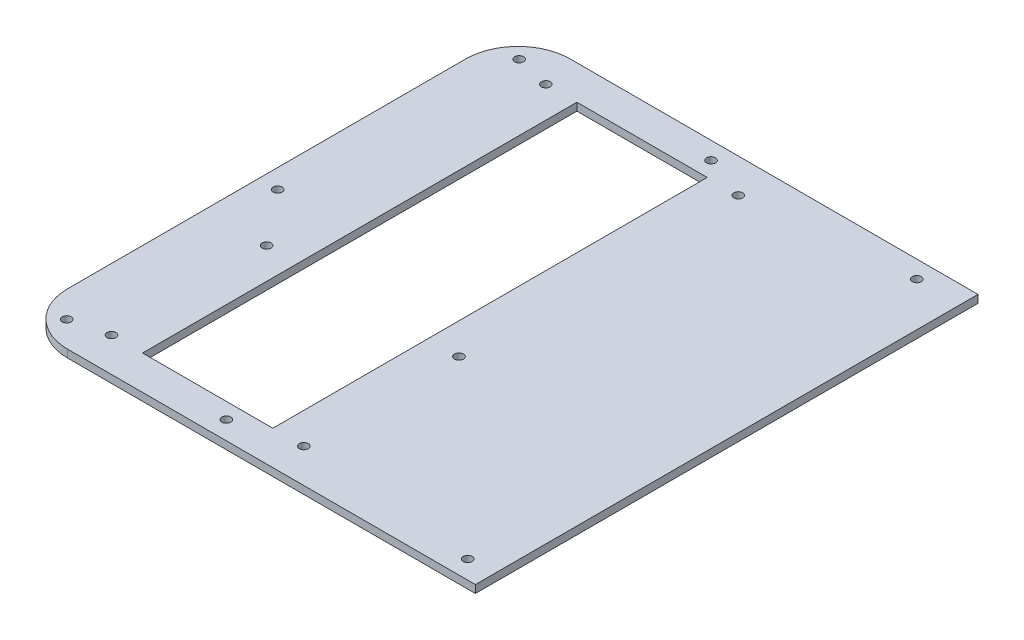
ISO-10303-21;
HEADER;
FILE_DESCRIPTION(('STEP AP214'),'2;1');
FILE_NAME('part.step','',(''),(''),'','','');
FILE_SCHEMA(('AUTOMOTIVE_DESIGN { 1 0 10303 214 1 1 1 1 }'));
ENDSEC;
DATA;
#1=APPLICATION_CONTEXT('core data for automotive mechanical design processes');
#2=APPLICATION_PROTOCOL_DEFINITION('international standard','automotive_design',2000,#1);
#3=PRODUCT_CONTEXT('',#1,'mechanical');
#4=PRODUCT('Part','Part','',(#3));
#5=PRODUCT_RELATED_PRODUCT_CATEGORY('part','',(#4));
#6=PRODUCT_DEFINITION_FORMATION('','',#4);
#7=PRODUCT_DEFINITION_CONTEXT('part definition',#1,'design');
#8=PRODUCT_DEFINITION('design','',#6,#7);
#9=PRODUCT_DEFINITION_SHAPE('','',#8);
#10=(LENGTH_UNIT() NAMED_UNIT(*) SI_UNIT(.MILLI.,.METRE.));
#11=(NAMED_UNIT(*) PLANE_ANGLE_UNIT() SI_UNIT($,.RADIAN.));
#12=(NAMED_UNIT(*) SI_UNIT($,.STERADIAN.) SOLID_ANGLE_UNIT());
#13=UNCERTAINTY_MEASURE_WITH_UNIT(LENGTH_MEASURE(1.E-05),#10,'distance_accuracy_value','');
#14=(GEOMETRIC_REPRESENTATION_CONTEXT(3) GLOBAL_UNCERTAINTY_ASSIGNED_CONTEXT((#13)) GLOBAL_UNIT_ASSIGNED_CONTEXT((#10,
#11,#12)) REPRESENTATION_CONTEXT('',''));
#15=CARTESIAN_POINT('',(0.,0.,0.));
#16=DIRECTION('',(0.,0.,1.));
#17=DIRECTION('',(1.,0.,0.));
#18=AXIS2_PLACEMENT_3D('',#15,#16,#17);
#19=CARTESIAN_POINT('',(-106.934,3.175,81.534));
#20=DIRECTION('',(0.,-1.,0.));
#21=DIRECTION('',(0.,0.,-1.));
#22=AXIS2_PLACEMENT_3D('',#19,#20,#21);
#23=PLANE('',#22);
#24=CARTESIAN_POINT('',(42.1132,3.175,-95.7453));
#25=DIRECTION('',(0.,1.,0.));
#26=DIRECTION('',(0.,0.,1.));
#27=AXIS2_PLACEMENT_3D('',#24,#25,#26);
#28=CIRCLE('',#27,1.82879999999998);
#29=CARTESIAN_POINT('',(42.1132,3.175,-93.9165));
#30=VERTEX_POINT('',#29);
#31=EDGE_CURVE('E196',#30,#30,#28,.T.);
#32=ORIENTED_EDGE('',*,*,#31,.F.);
#33=EDGE_LOOP('',(#32));
#34=FACE_BOUND('',#33,.T.);
#35=CARTESIAN_POINT('',(49.403,3.175,95.3643));
#36=DIRECTION('',(0.,1.,0.));
#37=DIRECTION('',(0.,0.,1.));
#38=AXIS2_PLACEMENT_3D('',#35,#36,#37);
#39=CIRCLE('',#38,1.82879999999998);
#40=CARTESIAN_POINT('',(49.403,3.175,97.1931));
#41=VERTEX_POINT('',#40);
#42=EDGE_CURVE('E206',#41,#41,#39,.T.);
#43=ORIENTED_EDGE('',*,*,#42,.F.);
#44=EDGE_LOOP('',(#43));
#45=FACE_BOUND('',#44,.T.);
#46=CARTESIAN_POINT('',(-49.403,3.175,95.3643));
#47=DIRECTION('',(0.,1.,0.));
#48=DIRECTION('',(0.,0.,1.));
#49=AXIS2_PLACEMENT_3D('',#46,#47,#48);
#50=CIRCLE('',#49,1.82879999999998);
#51=CARTESIAN_POINT('',(-49.403,3.175,97.1931));
#52=VERTEX_POINT('',#51);
#53=EDGE_CURVE('E214',#52,#52,#50,.T.);
#54=ORIENTED_EDGE('',*,*,#53,.F.);
#55=EDGE_LOOP('',(#54));
#56=FACE_BOUND('',#55,.T.);
#57=CARTESIAN_POINT('',(-117.6274,3.175,92.5195));
#58=DIRECTION('',(0.,1.,0.));
#59=DIRECTION('',(0.,0.,1.));
#60=AXIS2_PLACEMENT_3D('',#57,#58,#59);
#61=CIRCLE('',#60,1.82879999999999);
#62=CARTESIAN_POINT('',(-117.6274,3.175,94.3483));
#63=VERTEX_POINT('',#62);
#64=EDGE_CURVE('E222',#63,#63,#61,.T.);
#65=ORIENTED_EDGE('',*,*,#64,.F.);
#66=EDGE_LOOP('',(#65));
#67=FACE_BOUND('',#66,.T.);
#68=CARTESIAN_POINT('',(-120.4468,3.175,3.3147));
#69=DIRECTION('',(0.,1.,0.));
#70=DIRECTION('',(0.,0.,1.));
#71=AXIS2_PLACEMENT_3D('',#68,#69,#70);
#72=CIRCLE('',#71,1.82879999999999);
#73=CARTESIAN_POINT('',(-120.4468,3.175,5.1435));
#74=VERTEX_POINT('',#73);
#75=EDGE_CURVE('E230',#74,#74,#72,.T.);
#76=ORIENTED_EDGE('',*,*,#75,.F.);
#77=EDGE_LOOP('',(#76));
#78=FACE_BOUND('',#77,.T.);
#79=CARTESIAN_POINT('',(-117.221,3.175,-92.2909));
#80=DIRECTION('',(0.,1.,0.));
#81=DIRECTION('',(0.,0.,1.));
#82=AXIS2_PLACEMENT_3D('',#79,#80,#81);
#83=CIRCLE('',#82,1.82879999999999);
#84=CARTESIAN_POINT('',(-117.221,3.175,-90.4621));
#85=VERTEX_POINT('',#84);
#86=EDGE_CURVE('E238',#85,#85,#83,.T.);
#87=ORIENTED_EDGE('',*,*,#86,.F.);
#88=EDGE_LOOP('',(#87));
#89=FACE_BOUND('',#88,.T.);
#90=CARTESIAN_POINT('',(-42.1132,3.175,-95.7453));
#91=DIRECTION('',(0.,1.,0.));
#92=DIRECTION('',(0.,0.,1.));
#93=AXIS2_PLACEMENT_3D('',#90,#91,#92);
#94=CIRCLE('',#93,1.82879999999998);
#95=CARTESIAN_POINT('',(-42.1132,3.175,-93.9165));
#96=VERTEX_POINT('',#95);
#97=EDGE_CURVE('E246',#96,#96,#94,.T.);
#98=ORIENTED_EDGE('',*,*,#97,.F.);
#99=EDGE_LOOP('',(#98));
#100=FACE_BOUND('',#99,.T.);
#101=CARTESIAN_POINT('',(-24.13,3.175,25.4));
#102=DIRECTION('',(0.,1.,0.));
#103=DIRECTION('',(0.,0.,1.));
#104=AXIS2_PLACEMENT_3D('',#101,#102,#103);
#105=CIRCLE('',#104,1.82879999999999);
#106=CARTESIAN_POINT('',(-24.13,3.175,27.2288));
#107=VERTEX_POINT('',#106);
#108=EDGE_CURVE('E254',#107,#107,#105,.T.);
#109=ORIENTED_EDGE('',*,*,#108,.F.);
#110=EDGE_LOOP('',(#109));
#111=FACE_BOUND('',#110,.T.);
#112=CARTESIAN_POINT('',(-24.13,3.175,-88.9));
#113=DIRECTION('',(0.,1.,0.));
#114=DIRECTION('',(0.,0.,1.));
#115=AXIS2_PLACEMENT_3D('',#112,#113,#114);
#116=CIRCLE('',#115,1.82879999999999);
#117=CARTESIAN_POINT('',(-24.13,3.175,-87.0712));
#118=VERTEX_POINT('',#117);
#119=EDGE_CURVE('E262',#118,#118,#116,.T.);
#120=ORIENTED_EDGE('',*,*,#119,.F.);
#121=EDGE_LOOP('',(#120));
#122=FACE_BOUND('',#121,.T.);
#123=CARTESIAN_POINT('',(-102.87,3.175,-88.9));
#124=DIRECTION('',(0.,1.,0.));
#125=DIRECTION('',(0.,0.,1.));
#126=AXIS2_PLACEMENT_3D('',#123,#124,#125);
#127=CIRCLE('',#126,1.82879999999999);
#128=CARTESIAN_POINT('',(-102.87,3.175,-87.0712));
#129=VERTEX_POINT('',#128);
#130=EDGE_CURVE('E270',#129,#129,#127,.T.);
#131=ORIENTED_EDGE('',*,*,#130,.F.);
#132=EDGE_LOOP('',(#131));
#133=FACE_BOUND('',#132,.T.);
#134=CARTESIAN_POINT('',(-102.87,3.175,25.4));
#135=DIRECTION('',(0.,1.,0.));
#136=DIRECTION('',(0.,0.,1.));
#137=AXIS2_PLACEMENT_3D('',#134,#135,#136);
#138=CIRCLE('',#137,1.82879999999999);
#139=CARTESIAN_POINT('',(-102.87,3.175,27.2288));
#140=VERTEX_POINT('',#139);
#141=EDGE_CURVE('E278',#140,#140,#138,.T.);
#142=ORIENTED_EDGE('',*,*,#141,.F.);
#143=EDGE_LOOP('',(#142));
#144=FACE_BOUND('',#143,.T.);
#145=CARTESIAN_POINT('',(-102.87,3.175,88.9));
#146=DIRECTION('',(0.,1.,0.));
#147=DIRECTION('',(0.,0.,1.));
#148=AXIS2_PLACEMENT_3D('',#145,#146,#147);
#149=CIRCLE('',#148,1.82879999999999);
#150=CARTESIAN_POINT('',(-102.87,3.175,90.7288));
#151=VERTEX_POINT('',#150);
#152=EDGE_CURVE('E286',#151,#151,#149,.T.);
#153=ORIENTED_EDGE('',*,*,#152,.F.);
#154=EDGE_LOOP('',(#153));
#155=FACE_BOUND('',#154,.T.);
#156=CARTESIAN_POINT('',(-24.13,3.175,88.9));
#157=DIRECTION('',(0.,1.,0.));
#158=DIRECTION('',(0.,0.,1.));
#159=AXIS2_PLACEMENT_3D('',#156,#157,#158);
#160=CIRCLE('',#159,1.82879999999999);
#161=CARTESIAN_POINT('',(-24.13,3.175,90.7288));
#162=VERTEX_POINT('',#161);
#163=EDGE_CURVE('E294',#162,#162,#160,.T.);
#164=ORIENTED_EDGE('',*,*,#163,.F.);
#165=EDGE_LOOP('',(#164));
#166=FACE_BOUND('',#165,.T.);
#167=DIRECTION('',(1.,0.,0.));
#168=VECTOR('',#167,1.);
#169=CARTESIAN_POINT('',(-106.934,3.175,102.87));
#170=LINE('',#169,#168);
#171=CARTESIAN_POINT('',(-106.934,3.175,102.87));
#172=VERTEX_POINT('',#171);
#173=CARTESIAN_POINT('',(60.0455999999999,3.175,102.87));
#174=VERTEX_POINT('',#173);
#175=EDGE_CURVE('E131',#172,#174,#170,.T.);
#176=ORIENTED_EDGE('',*,*,#175,.T.);
#177=DIRECTION('',(0.,0.,1.));
#178=VECTOR('',#177,1.);
#179=CARTESIAN_POINT('',(60.0455999999999,3.175,127.));
#180=LINE('',#179,#178);
#181=CARTESIAN_POINT('',(60.0455999999999,3.175,-102.87));
#182=VERTEX_POINT('',#181);
#183=EDGE_CURVE('E120',#182,#174,#180,.T.);
#184=ORIENTED_EDGE('',*,*,#183,.F.);
#185=DIRECTION('',(-1.,0.,0.));
#186=VECTOR('',#185,1.);
#187=CARTESIAN_POINT('',(-106.934,3.175,-102.87));
#188=LINE('',#187,#186);
#189=CARTESIAN_POINT('',(-106.934,3.175,-102.87));
#190=VERTEX_POINT('',#189);
#191=EDGE_CURVE('E128',#182,#190,#188,.T.);
#192=ORIENTED_EDGE('',*,*,#191,.T.);
#193=CARTESIAN_POINT('',(-106.934,3.175,-81.534));
#194=DIRECTION('',(0.,1.,0.));
#195=DIRECTION('',(0.,0.,-1.));
#196=AXIS2_PLACEMENT_3D('',#193,#194,#195);
#197=CIRCLE('',#196,21.336);
#198=CARTESIAN_POINT('',(-128.27,3.175,-81.5339999999998));
#199=VERTEX_POINT('',#198);
#200=EDGE_CURVE('E139',#190,#199,#197,.T.);
#201=ORIENTED_EDGE('',*,*,#200,.T.);
#202=DIRECTION('',(0.,0.,1.));
#203=VECTOR('',#202,1.);
#204=CARTESIAN_POINT('',(-128.27,3.175,81.5339999999998));
#205=LINE('',#204,#203);
#206=CARTESIAN_POINT('',(-128.27,3.175,81.5339999999998));
#207=VERTEX_POINT('',#206);
#208=EDGE_CURVE('E143',#199,#207,#205,.T.);
#209=ORIENTED_EDGE('',*,*,#208,.T.);
#210=CARTESIAN_POINT('',(-106.934,3.175,81.534));
#211=DIRECTION('',(0.,1.,0.));
#212=DIRECTION('',(0.,0.,-1.));
#213=AXIS2_PLACEMENT_3D('',#210,#211,#212);
#214=CIRCLE('',#213,21.336);
#215=EDGE_CURVE('E145',#207,#172,#214,.T.);
#216=ORIENTED_EDGE('',*,*,#215,.T.);
#217=EDGE_LOOP('',(#176,#184,#192,#201,#209,#216));
#218=FACE_BOUND('',#217,.T.);
#219=DIRECTION('',(0.,0.,-1.));
#220=VECTOR('',#219,1.);
#221=CARTESIAN_POINT('',(-36.83,3.175,-88.9));
#222=LINE('',#221,#220);
#223=CARTESIAN_POINT('',(-36.83,3.175,88.9));
#224=VERTEX_POINT('',#223);
#225=CARTESIAN_POINT('',(-36.83,3.175,-88.9));
#226=VERTEX_POINT('',#225);
#227=EDGE_CURVE('E303',#224,#226,#222,.T.);
#228=ORIENTED_EDGE('',*,*,#227,.F.);
#229=DIRECTION('',(1.,0.,0.));
#230=VECTOR('',#229,1.);
#231=CARTESIAN_POINT('',(-90.17,3.175,88.9));
#232=LINE('',#231,#230);
#233=CARTESIAN_POINT('',(-90.17,3.175,88.9));
#234=VERTEX_POINT('',#233);
#235=EDGE_CURVE('E313',#234,#224,#232,.T.);
#236=ORIENTED_EDGE('',*,*,#235,.F.);
#237=DIRECTION('',(0.,0.,1.));
#238=VECTOR('',#237,1.);
#239=CARTESIAN_POINT('',(-90.17,3.175,-88.9));
#240=LINE('',#239,#238);
#241=CARTESIAN_POINT('',(-90.17,3.175,-88.9));
#242=VERTEX_POINT('',#241);
#243=EDGE_CURVE('E310',#242,#234,#240,.T.);
#244=ORIENTED_EDGE('',*,*,#243,.F.);
#245=DIRECTION('',(-1.,0.,0.));
#246=VECTOR('',#245,1.);
#247=CARTESIAN_POINT('',(-90.17,3.175,-88.9));
#248=LINE('',#247,#246);
#249=EDGE_CURVE('E306',#226,#242,#248,.T.);
#250=ORIENTED_EDGE('',*,*,#249,.F.);
#251=EDGE_LOOP('',(#228,#236,#244,#250));
#252=FACE_BOUND('',#251,.T.);
#253=ADVANCED_FACE('F44',(#34,#45,#56,#67,#78,#89,#100,#111,#122,#133,#144,#155,#166,#218,#252),
#23,.F.);
#254=CARTESIAN_POINT('',(-106.934,0.,81.534));
#255=DIRECTION('',(0.,-1.,0.));
#256=DIRECTION('',(0.,0.,-1.));
#257=AXIS2_PLACEMENT_3D('',#254,#255,#256);
#258=PLANE('',#257);
#259=DIRECTION('',(0.,0.,-1.));
#260=VECTOR('',#259,1.);
#261=CARTESIAN_POINT('',(60.0455999999999,0.,81.534));
#262=LINE('',#261,#260);
#263=CARTESIAN_POINT('',(60.0455999999999,0.,102.87));
#264=VERTEX_POINT('',#263);
#265=CARTESIAN_POINT('',(60.0455999999999,0.,-102.87));
#266=VERTEX_POINT('',#265);
#267=EDGE_CURVE('E60',#264,#266,#262,.T.);
#268=ORIENTED_EDGE('',*,*,#267,.F.);
#269=DIRECTION('',(1.,0.,0.));
#270=VECTOR('',#269,1.);
#271=CARTESIAN_POINT('',(-106.934,0.,102.87));
#272=LINE('',#271,#270);
#273=CARTESIAN_POINT('',(-106.934,0.,102.87));
#274=VERTEX_POINT('',#273);
#275=EDGE_CURVE('E156',#274,#264,#272,.T.);
#276=ORIENTED_EDGE('',*,*,#275,.F.);
#277=CARTESIAN_POINT('',(-106.934,0.,81.534));
#278=DIRECTION('',(0.,1.,0.));
#279=DIRECTION('',(0.,0.,-1.));
#280=AXIS2_PLACEMENT_3D('',#277,#278,#279);
#281=CIRCLE('',#280,21.336);
#282=CARTESIAN_POINT('',(-128.27,0.,81.5339999999998));
#283=VERTEX_POINT('',#282);
#284=EDGE_CURVE('E152',#283,#274,#281,.T.);
#285=ORIENTED_EDGE('',*,*,#284,.F.);
#286=DIRECTION('',(0.,0.,1.));
#287=VECTOR('',#286,1.);
#288=CARTESIAN_POINT('',(-128.27,0.,81.5339999999998));
#289=LINE('',#288,#287);
#290=CARTESIAN_POINT('',(-128.27,0.,-81.5339999999998));
#291=VERTEX_POINT('',#290);
#292=EDGE_CURVE('E167',#291,#283,#289,.T.);
#293=ORIENTED_EDGE('',*,*,#292,.F.);
#294=CARTESIAN_POINT('',(-106.934,0.,-81.534));
#295=DIRECTION('',(0.,1.,0.));
#296=DIRECTION('',(0.,0.,-1.));
#297=AXIS2_PLACEMENT_3D('',#294,#295,#296);
#298=CIRCLE('',#297,21.336);
#299=CARTESIAN_POINT('',(-106.934,0.,-102.87));
#300=VERTEX_POINT('',#299);
#301=EDGE_CURVE('E164',#300,#291,#298,.T.);
#302=ORIENTED_EDGE('',*,*,#301,.F.);
#303=DIRECTION('',(-1.,0.,0.));
#304=VECTOR('',#303,1.);
#305=CARTESIAN_POINT('',(-106.934,0.,-102.87));
#306=LINE('',#305,#304);
#307=EDGE_CURVE('E161',#266,#300,#306,.T.);
#308=ORIENTED_EDGE('',*,*,#307,.F.);
#309=EDGE_LOOP('',(#268,#276,#285,#293,#302,#308));
#310=FACE_BOUND('',#309,.T.);
#311=CARTESIAN_POINT('',(42.1132,0.,-95.7453));
#312=DIRECTION('',(0.,1.,0.));
#313=DIRECTION('',(0.,0.,1.));
#314=AXIS2_PLACEMENT_3D('',#311,#312,#313);
#315=CIRCLE('',#314,1.8288);
#316=CARTESIAN_POINT('',(42.1132,0.,-93.9165));
#317=VERTEX_POINT('',#316);
#318=EDGE_CURVE('E202',#317,#317,#315,.T.);
#319=ORIENTED_EDGE('',*,*,#318,.T.);
#320=EDGE_LOOP('',(#319));
#321=FACE_BOUND('',#320,.T.);
#322=CARTESIAN_POINT('',(49.403,0.,95.3643));
#323=DIRECTION('',(0.,1.,0.));
#324=DIRECTION('',(0.,0.,1.));
#325=AXIS2_PLACEMENT_3D('',#322,#323,#324);
#326=CIRCLE('',#325,1.8288);
#327=CARTESIAN_POINT('',(49.403,0.,97.1931));
#328=VERTEX_POINT('',#327);
#329=EDGE_CURVE('E210',#328,#328,#326,.T.);
#330=ORIENTED_EDGE('',*,*,#329,.T.);
#331=EDGE_LOOP('',(#330));
#332=FACE_BOUND('',#331,.T.);
#333=CARTESIAN_POINT('',(-49.403,0.,95.3643));
#334=DIRECTION('',(0.,1.,0.));
#335=DIRECTION('',(0.,0.,1.));
#336=AXIS2_PLACEMENT_3D('',#333,#334,#335);
#337=CIRCLE('',#336,1.8288);
#338=CARTESIAN_POINT('',(-49.403,0.,97.1931));
#339=VERTEX_POINT('',#338);
#340=EDGE_CURVE('E218',#339,#339,#337,.T.);
#341=ORIENTED_EDGE('',*,*,#340,.T.);
#342=EDGE_LOOP('',(#341));
#343=FACE_BOUND('',#342,.T.);
#344=CARTESIAN_POINT('',(-117.6274,0.,92.5195));
#345=DIRECTION('',(0.,1.,0.));
#346=DIRECTION('',(0.,0.,1.));
#347=AXIS2_PLACEMENT_3D('',#344,#345,#346);
#348=CIRCLE('',#347,1.82880000000001);
#349=CARTESIAN_POINT('',(-117.6274,0.,94.3483));
#350=VERTEX_POINT('',#349);
#351=EDGE_CURVE('E226',#350,#350,#348,.T.);
#352=ORIENTED_EDGE('',*,*,#351,.T.);
#353=EDGE_LOOP('',(#352));
#354=FACE_BOUND('',#353,.T.);
#355=CARTESIAN_POINT('',(-120.4468,0.,3.3147));
#356=DIRECTION('',(0.,1.,0.));
#357=DIRECTION('',(0.,0.,1.));
#358=AXIS2_PLACEMENT_3D('',#355,#356,#357);
#359=CIRCLE('',#358,1.82880000000001);
#360=CARTESIAN_POINT('',(-120.4468,0.,5.14350000000001));
#361=VERTEX_POINT('',#360);
#362=EDGE_CURVE('E234',#361,#361,#359,.T.);
#363=ORIENTED_EDGE('',*,*,#362,.T.);
#364=EDGE_LOOP('',(#363));
#365=FACE_BOUND('',#364,.T.);
#366=CARTESIAN_POINT('',(-117.221,0.,-92.2909));
#367=DIRECTION('',(0.,1.,0.));
#368=DIRECTION('',(0.,0.,1.));
#369=AXIS2_PLACEMENT_3D('',#366,#367,#368);
#370=CIRCLE('',#369,1.82880000000001);
#371=CARTESIAN_POINT('',(-117.221,0.,-90.4621));
#372=VERTEX_POINT('',#371);
#373=EDGE_CURVE('E242',#372,#372,#370,.T.);
#374=ORIENTED_EDGE('',*,*,#373,.T.);
#375=EDGE_LOOP('',(#374));
#376=FACE_BOUND('',#375,.T.);
#377=CARTESIAN_POINT('',(-42.1132,0.,-95.7453));
#378=DIRECTION('',(0.,1.,0.));
#379=DIRECTION('',(0.,0.,1.));
#380=AXIS2_PLACEMENT_3D('',#377,#378,#379);
#381=CIRCLE('',#380,1.8288);
#382=CARTESIAN_POINT('',(-42.1132,0.,-93.9165));
#383=VERTEX_POINT('',#382);
#384=EDGE_CURVE('E250',#383,#383,#381,.T.);
#385=ORIENTED_EDGE('',*,*,#384,.T.);
#386=EDGE_LOOP('',(#385));
#387=FACE_BOUND('',#386,.T.);
#388=CARTESIAN_POINT('',(-24.13,0.,25.4));
#389=DIRECTION('',(0.,1.,0.));
#390=DIRECTION('',(0.,0.,1.));
#391=AXIS2_PLACEMENT_3D('',#388,#389,#390);
#392=CIRCLE('',#391,1.8288);
#393=CARTESIAN_POINT('',(-24.13,0.,27.2288));
#394=VERTEX_POINT('',#393);
#395=EDGE_CURVE('E258',#394,#394,#392,.T.);
#396=ORIENTED_EDGE('',*,*,#395,.T.);
#397=EDGE_LOOP('',(#396));
#398=FACE_BOUND('',#397,.T.);
#399=CARTESIAN_POINT('',(-24.13,0.,-88.9));
#400=DIRECTION('',(0.,1.,0.));
#401=DIRECTION('',(0.,0.,1.));
#402=AXIS2_PLACEMENT_3D('',#399,#400,#401);
#403=CIRCLE('',#402,1.8288);
#404=CARTESIAN_POINT('',(-24.13,0.,-87.0712));
#405=VERTEX_POINT('',#404);
#406=EDGE_CURVE('E266',#405,#405,#403,.T.);
#407=ORIENTED_EDGE('',*,*,#406,.T.);
#408=EDGE_LOOP('',(#407));
#409=FACE_BOUND('',#408,.T.);
#410=CARTESIAN_POINT('',(-102.87,0.,-88.9));
#411=DIRECTION('',(0.,1.,0.));
#412=DIRECTION('',(0.,0.,1.));
#413=AXIS2_PLACEMENT_3D('',#410,#411,#412);
#414=CIRCLE('',#413,1.82880000000001);
#415=CARTESIAN_POINT('',(-102.87,0.,-87.0712));
#416=VERTEX_POINT('',#415);
#417=EDGE_CURVE('E274',#416,#416,#414,.T.);
#418=ORIENTED_EDGE('',*,*,#417,.T.);
#419=EDGE_LOOP('',(#418));
#420=FACE_BOUND('',#419,.T.);
#421=CARTESIAN_POINT('',(-102.87,0.,25.4));
#422=DIRECTION('',(0.,1.,0.));
#423=DIRECTION('',(0.,0.,1.));
#424=AXIS2_PLACEMENT_3D('',#421,#422,#423);
#425=CIRCLE('',#424,1.82880000000001);
#426=CARTESIAN_POINT('',(-102.87,0.,27.2288));
#427=VERTEX_POINT('',#426);
#428=EDGE_CURVE('E282',#427,#427,#425,.T.);
#429=ORIENTED_EDGE('',*,*,#428,.T.);
#430=EDGE_LOOP('',(#429));
#431=FACE_BOUND('',#430,.T.);
#432=CARTESIAN_POINT('',(-102.87,0.,88.9));
#433=DIRECTION('',(0.,1.,0.));
#434=DIRECTION('',(0.,0.,1.));
#435=AXIS2_PLACEMENT_3D('',#432,#433,#434);
#436=CIRCLE('',#435,1.82880000000001);
#437=CARTESIAN_POINT('',(-102.87,0.,90.7288));
#438=VERTEX_POINT('',#437);
#439=EDGE_CURVE('E290',#438,#438,#436,.T.);
#440=ORIENTED_EDGE('',*,*,#439,.T.);
#441=EDGE_LOOP('',(#440));
#442=FACE_BOUND('',#441,.T.);
#443=CARTESIAN_POINT('',(-24.13,0.,88.9));
#444=DIRECTION('',(0.,1.,0.));
#445=DIRECTION('',(0.,0.,1.));
#446=AXIS2_PLACEMENT_3D('',#443,#444,#445);
#447=CIRCLE('',#446,1.8288);
#448=CARTESIAN_POINT('',(-24.13,0.,90.7288));
#449=VERTEX_POINT('',#448);
#450=EDGE_CURVE('E298',#449,#449,#447,.T.);
#451=ORIENTED_EDGE('',*,*,#450,.T.);
#452=EDGE_LOOP('',(#451));
#453=FACE_BOUND('',#452,.T.);
#454=DIRECTION('',(1.,0.,0.));
#455=VECTOR('',#454,1.);
#456=CARTESIAN_POINT('',(-90.17,0.,88.9));
#457=LINE('',#456,#455);
#458=CARTESIAN_POINT('',(-90.17,0.,88.9));
#459=VERTEX_POINT('',#458);
#460=CARTESIAN_POINT('',(-36.83,0.,88.9));
#461=VERTEX_POINT('',#460);
#462=EDGE_CURVE('E307',#459,#461,#457,.T.);
#463=ORIENTED_EDGE('',*,*,#462,.T.);
#464=DIRECTION('',(0.,0.,-1.));
#465=VECTOR('',#464,1.);
#466=CARTESIAN_POINT('',(-36.83,0.,-88.9));
#467=LINE('',#466,#465);
#468=CARTESIAN_POINT('',(-36.83,0.,-88.9));
#469=VERTEX_POINT('',#468);
#470=EDGE_CURVE('E302',#461,#469,#467,.T.);
#471=ORIENTED_EDGE('',*,*,#470,.T.);
#472=DIRECTION('',(-1.,0.,0.));
#473=VECTOR('',#472,1.);
#474=CARTESIAN_POINT('',(-90.17,0.,-88.9));
#475=LINE('',#474,#473);
#476=CARTESIAN_POINT('',(-90.17,0.,-88.9));
#477=VERTEX_POINT('',#476);
#478=EDGE_CURVE('E320',#469,#477,#475,.T.);
#479=ORIENTED_EDGE('',*,*,#478,.T.);
#480=DIRECTION('',(0.,0.,1.));
#481=VECTOR('',#480,1.);
#482=CARTESIAN_POINT('',(-90.17,0.,-88.9));
#483=LINE('',#482,#481);
#484=EDGE_CURVE('E324',#477,#459,#483,.T.);
#485=ORIENTED_EDGE('',*,*,#484,.T.);
#486=EDGE_LOOP('',(#463,#471,#479,#485));
#487=FACE_BOUND('',#486,.T.);
#488=ADVANCED_FACE('F189',(#310,#321,#332,#343,#354,#365,#376,#387,#398,#409,#420,#431,#442,
#453,#487),#258,.T.);
#489=CARTESIAN_POINT('',(-106.934,3.175,81.534));
#490=DIRECTION('',(0.,-1.,0.));
#491=DIRECTION('',(0.,0.,-1.));
#492=AXIS2_PLACEMENT_3D('',#489,#490,#491);
#493=CYLINDRICAL_SURFACE('',#492,21.336);
#494=ORIENTED_EDGE('',*,*,#284,.T.);
#495=DIRECTION('',(0.,-1.,0.));
#496=VECTOR('',#495,1.);
#497=CARTESIAN_POINT('',(-106.934,3.175,102.87));
#498=LINE('',#497,#496);
#499=EDGE_CURVE('E53',#172,#274,#498,.T.);
#500=ORIENTED_EDGE('',*,*,#499,.F.);
#501=ORIENTED_EDGE('',*,*,#215,.F.);
#502=DIRECTION('',(0.,-1.,0.));
#503=VECTOR('',#502,1.);
#504=CARTESIAN_POINT('',(-128.27,3.175,81.5339999999998));
#505=LINE('',#504,#503);
#506=EDGE_CURVE('E151',#207,#283,#505,.T.);
#507=ORIENTED_EDGE('',*,*,#506,.T.);
#508=EDGE_LOOP('',(#494,#500,#501,#507));
#509=FACE_BOUND('',#508,.T.);
#510=ADVANCED_FACE('F46',(#509),#493,.T.);
#511=CARTESIAN_POINT('',(-106.934,3.175,102.87));
#512=DIRECTION('',(0.,0.,-1.));
#513=DIRECTION('',(-1.,0.,0.));
#514=AXIS2_PLACEMENT_3D('',#511,#512,#513);
#515=PLANE('',#514);
#516=ORIENTED_EDGE('',*,*,#275,.T.);
#517=DIRECTION('',(0.,1.,0.));
#518=VECTOR('',#517,1.);
#519=CARTESIAN_POINT('',(60.0455999999999,3.175,102.87));
#520=LINE('',#519,#518);
#521=EDGE_CURVE('E193',#264,#174,#520,.T.);
#522=ORIENTED_EDGE('',*,*,#521,.T.);
#523=ORIENTED_EDGE('',*,*,#175,.F.);
#524=ORIENTED_EDGE('',*,*,#499,.T.);
#525=EDGE_LOOP('',(#516,#522,#523,#524));
#526=FACE_BOUND('',#525,.T.);
#527=ADVANCED_FACE('F182',(#526),#515,.F.);
#528=CARTESIAN_POINT('',(-106.934,3.175,-102.87));
#529=DIRECTION('',(0.,0.,1.));
#530=DIRECTION('',(1.,0.,0.));
#531=AXIS2_PLACEMENT_3D('',#528,#529,#530);
#532=PLANE('',#531);
#533=ORIENTED_EDGE('',*,*,#191,.F.);
#534=DIRECTION('',(0.,-1.,0.));
#535=VECTOR('',#534,1.);
#536=CARTESIAN_POINT('',(60.0455999999999,3.175,-102.87));
#537=LINE('',#536,#535);
#538=EDGE_CURVE('E11',#182,#266,#537,.T.);
#539=ORIENTED_EDGE('',*,*,#538,.T.);
#540=ORIENTED_EDGE('',*,*,#307,.T.);
#541=DIRECTION('',(0.,-1.,0.));
#542=VECTOR('',#541,1.);
#543=CARTESIAN_POINT('',(-106.934,3.175,-102.87));
#544=LINE('',#543,#542);
#545=EDGE_CURVE('E136',#190,#300,#544,.T.);
#546=ORIENTED_EDGE('',*,*,#545,.F.);
#547=EDGE_LOOP('',(#533,#539,#540,#546));
#548=FACE_BOUND('',#547,.T.);
#549=ADVANCED_FACE('F134',(#548),#532,.F.);
#550=CARTESIAN_POINT('',(-106.934,3.175,-81.534));
#551=DIRECTION('',(0.,-1.,0.));
#552=DIRECTION('',(0.,0.,-1.));
#553=AXIS2_PLACEMENT_3D('',#550,#551,#552);
#554=CYLINDRICAL_SURFACE('',#553,21.336);
#555=ORIENTED_EDGE('',*,*,#301,.T.);
#556=DIRECTION('',(0.,-1.,0.));
#557=VECTOR('',#556,1.);
#558=CARTESIAN_POINT('',(-128.27,3.175,-81.5339999999998));
#559=LINE('',#558,#557);
#560=EDGE_CURVE('E173',#199,#291,#559,.T.);
#561=ORIENTED_EDGE('',*,*,#560,.F.);
#562=ORIENTED_EDGE('',*,*,#200,.F.);
#563=ORIENTED_EDGE('',*,*,#545,.T.);
#564=EDGE_LOOP('',(#555,#561,#562,#563));
#565=FACE_BOUND('',#564,.T.);
#566=ADVANCED_FACE('F347',(#565),#554,.T.);
#567=CARTESIAN_POINT('',(-128.27,3.175,81.5339999999998));
#568=DIRECTION('',(1.,0.,0.));
#569=DIRECTION('',(0.,0.,-1.));
#570=AXIS2_PLACEMENT_3D('',#567,#568,#569);
#571=PLANE('',#570);
#572=ORIENTED_EDGE('',*,*,#292,.T.);
#573=ORIENTED_EDGE('',*,*,#506,.F.);
#574=ORIENTED_EDGE('',*,*,#208,.F.);
#575=ORIENTED_EDGE('',*,*,#560,.T.);
#576=EDGE_LOOP('',(#572,#573,#574,#575));
#577=FACE_BOUND('',#576,.T.);
#578=ADVANCED_FACE('F345',(#577),#571,.F.);
#579=CARTESIAN_POINT('',(-36.83,3.175,-88.9));
#580=DIRECTION('',(-1.,0.,0.));
#581=DIRECTION('',(0.,0.,1.));
#582=AXIS2_PLACEMENT_3D('',#579,#580,#581);
#583=PLANE('',#582);
#584=ORIENTED_EDGE('',*,*,#470,.F.);
#585=DIRECTION('',(0.,-1.,0.));
#586=VECTOR('',#585,1.);
#587=CARTESIAN_POINT('',(-36.83,3.175,88.9));
#588=LINE('',#587,#586);
#589=EDGE_CURVE('E316',#224,#461,#588,.T.);
#590=ORIENTED_EDGE('',*,*,#589,.F.);
#591=ORIENTED_EDGE('',*,*,#227,.T.);
#592=DIRECTION('',(0.,-1.,0.));
#593=VECTOR('',#592,1.);
#594=CARTESIAN_POINT('',(-36.83,3.175,-88.9));
#595=LINE('',#594,#593);
#596=EDGE_CURVE('E157',#226,#469,#595,.T.);
#597=ORIENTED_EDGE('',*,*,#596,.T.);
#598=EDGE_LOOP('',(#584,#590,#591,#597));
#599=FACE_BOUND('',#598,.T.);
#600=ADVANCED_FACE('F354',(#599),#583,.T.);
#601=CARTESIAN_POINT('',(-90.17,3.175,-88.9));
#602=DIRECTION('',(0.,0.,1.));
#603=DIRECTION('',(1.,0.,0.));
#604=AXIS2_PLACEMENT_3D('',#601,#602,#603);
#605=PLANE('',#604);
#606=ORIENTED_EDGE('',*,*,#478,.F.);
#607=ORIENTED_EDGE('',*,*,#596,.F.);
#608=ORIENTED_EDGE('',*,*,#249,.T.);
#609=DIRECTION('',(0.,-1.,0.));
#610=VECTOR('',#609,1.);
#611=CARTESIAN_POINT('',(-90.17,3.175,-88.9));
#612=LINE('',#611,#610);
#613=EDGE_CURVE('E336',#242,#477,#612,.T.);
#614=ORIENTED_EDGE('',*,*,#613,.T.);
#615=EDGE_LOOP('',(#606,#607,#608,#614));
#616=FACE_BOUND('',#615,.T.);
#617=ADVANCED_FACE('F371',(#616),#605,.T.);
#618=CARTESIAN_POINT('',(-90.17,3.175,-88.9));
#619=DIRECTION('',(1.,0.,0.));
#620=DIRECTION('',(0.,0.,-1.));
#621=AXIS2_PLACEMENT_3D('',#618,#619,#620);
#622=PLANE('',#621);
#623=ORIENTED_EDGE('',*,*,#484,.F.);
#624=ORIENTED_EDGE('',*,*,#613,.F.);
#625=ORIENTED_EDGE('',*,*,#243,.T.);
#626=DIRECTION('',(0.,-1.,0.));
#627=VECTOR('',#626,1.);
#628=CARTESIAN_POINT('',(-90.17,3.175,88.9));
#629=LINE('',#628,#627);
#630=EDGE_CURVE('E67',#234,#459,#629,.T.);
#631=ORIENTED_EDGE('',*,*,#630,.T.);
#632=EDGE_LOOP('',(#623,#624,#625,#631));
#633=FACE_BOUND('',#632,.T.);
#634=ADVANCED_FACE('F375',(#633),#622,.T.);
#635=CARTESIAN_POINT('',(-90.17,3.175,88.9));
#636=DIRECTION('',(0.,0.,-1.));
#637=DIRECTION('',(-1.,0.,0.));
#638=AXIS2_PLACEMENT_3D('',#635,#636,#637);
#639=PLANE('',#638);
#640=ORIENTED_EDGE('',*,*,#462,.F.);
#641=ORIENTED_EDGE('',*,*,#630,.F.);
#642=ORIENTED_EDGE('',*,*,#235,.T.);
#643=ORIENTED_EDGE('',*,*,#589,.T.);
#644=EDGE_LOOP('',(#640,#641,#642,#643));
#645=FACE_BOUND('',#644,.T.);
#646=ADVANCED_FACE('F379',(#645),#639,.T.);
#647=CARTESIAN_POINT('',(-24.13,3.175,88.9));
#648=DIRECTION('',(0.,1.,0.));
#649=DIRECTION('',(0.,0.,1.));
#650=AXIS2_PLACEMENT_3D('',#647,#648,#649);
#651=CYLINDRICAL_SURFACE('',#650,1.82879999999999);
#652=ORIENTED_EDGE('',*,*,#450,.F.);
#653=EDGE_LOOP('',(#652));
#654=FACE_BOUND('',#653,.T.);
#655=ORIENTED_EDGE('',*,*,#163,.T.);
#656=EDGE_LOOP('',(#655));
#657=FACE_BOUND('',#656,.T.);
#658=ADVANCED_FACE('F383',(#654,#657),#651,.F.);
#659=CARTESIAN_POINT('',(-102.87,3.175,88.9));
#660=DIRECTION('',(0.,1.,0.));
#661=DIRECTION('',(0.,0.,1.));
#662=AXIS2_PLACEMENT_3D('',#659,#660,#661);
#663=CYLINDRICAL_SURFACE('',#662,1.8288);
#664=ORIENTED_EDGE('',*,*,#439,.F.);
#665=EDGE_LOOP('',(#664));
#666=FACE_BOUND('',#665,.T.);
#667=ORIENTED_EDGE('',*,*,#152,.T.);
#668=EDGE_LOOP('',(#667));
#669=FACE_BOUND('',#668,.T.);
#670=ADVANCED_FACE('F386',(#666,#669),#663,.F.);
#671=CARTESIAN_POINT('',(-102.87,3.175,25.4));
#672=DIRECTION('',(0.,1.,0.));
#673=DIRECTION('',(0.,0.,1.));
#674=AXIS2_PLACEMENT_3D('',#671,#672,#673);
#675=CYLINDRICAL_SURFACE('',#674,1.8288);
#676=ORIENTED_EDGE('',*,*,#428,.F.);
#677=EDGE_LOOP('',(#676));
#678=FACE_BOUND('',#677,.T.);
#679=ORIENTED_EDGE('',*,*,#141,.T.);
#680=EDGE_LOOP('',(#679));
#681=FACE_BOUND('',#680,.T.);
#682=ADVANCED_FACE('F390',(#678,#681),#675,.F.);
#683=CARTESIAN_POINT('',(-102.87,3.175,-88.9));
#684=DIRECTION('',(0.,1.,0.));
#685=DIRECTION('',(0.,0.,1.));
#686=AXIS2_PLACEMENT_3D('',#683,#684,#685);
#687=CYLINDRICAL_SURFACE('',#686,1.8288);
#688=ORIENTED_EDGE('',*,*,#417,.F.);
#689=EDGE_LOOP('',(#688));
#690=FACE_BOUND('',#689,.T.);
#691=ORIENTED_EDGE('',*,*,#130,.T.);
#692=EDGE_LOOP('',(#691));
#693=FACE_BOUND('',#692,.T.);
#694=ADVANCED_FACE('F394',(#690,#693),#687,.F.);
#695=CARTESIAN_POINT('',(-24.13,3.175,-88.9));
#696=DIRECTION('',(0.,1.,0.));
#697=DIRECTION('',(0.,0.,1.));
#698=AXIS2_PLACEMENT_3D('',#695,#696,#697);
#699=CYLINDRICAL_SURFACE('',#698,1.82879999999999);
#700=ORIENTED_EDGE('',*,*,#406,.F.);
#701=EDGE_LOOP('',(#700));
#702=FACE_BOUND('',#701,.T.);
#703=ORIENTED_EDGE('',*,*,#119,.T.);
#704=EDGE_LOOP('',(#703));
#705=FACE_BOUND('',#704,.T.);
#706=ADVANCED_FACE('F398',(#702,#705),#699,.F.);
#707=CARTESIAN_POINT('',(-24.13,3.175,25.4));
#708=DIRECTION('',(0.,1.,0.));
#709=DIRECTION('',(0.,0.,1.));
#710=AXIS2_PLACEMENT_3D('',#707,#708,#709);
#711=CYLINDRICAL_SURFACE('',#710,1.82879999999999);
#712=ORIENTED_EDGE('',*,*,#395,.F.);
#713=EDGE_LOOP('',(#712));
#714=FACE_BOUND('',#713,.T.);
#715=ORIENTED_EDGE('',*,*,#108,.T.);
#716=EDGE_LOOP('',(#715));
#717=FACE_BOUND('',#716,.T.);
#718=ADVANCED_FACE('F402',(#714,#717),#711,.F.);
#719=CARTESIAN_POINT('',(-42.1132,3.175,-95.7453));
#720=DIRECTION('',(0.,1.,0.));
#721=DIRECTION('',(0.,0.,1.));
#722=AXIS2_PLACEMENT_3D('',#719,#720,#721);
#723=CYLINDRICAL_SURFACE('',#722,1.82879999999999);
#724=ORIENTED_EDGE('',*,*,#384,.F.);
#725=EDGE_LOOP('',(#724));
#726=FACE_BOUND('',#725,.T.);
#727=ORIENTED_EDGE('',*,*,#97,.T.);
#728=EDGE_LOOP('',(#727));
#729=FACE_BOUND('',#728,.T.);
#730=ADVANCED_FACE('F406',(#726,#729),#723,.F.);
#731=CARTESIAN_POINT('',(-117.221,3.175,-92.2909));
#732=DIRECTION('',(0.,1.,0.));
#733=DIRECTION('',(0.,0.,1.));
#734=AXIS2_PLACEMENT_3D('',#731,#732,#733);
#735=CYLINDRICAL_SURFACE('',#734,1.8288);
#736=ORIENTED_EDGE('',*,*,#373,.F.);
#737=EDGE_LOOP('',(#736));
#738=FACE_BOUND('',#737,.T.);
#739=ORIENTED_EDGE('',*,*,#86,.T.);
#740=EDGE_LOOP('',(#739));
#741=FACE_BOUND('',#740,.T.);
#742=ADVANCED_FACE('F410',(#738,#741),#735,.F.);
#743=CARTESIAN_POINT('',(-120.4468,3.175,3.3147));
#744=DIRECTION('',(0.,1.,0.));
#745=DIRECTION('',(0.,0.,1.));
#746=AXIS2_PLACEMENT_3D('',#743,#744,#745);
#747=CYLINDRICAL_SURFACE('',#746,1.8288);
#748=ORIENTED_EDGE('',*,*,#362,.F.);
#749=EDGE_LOOP('',(#748));
#750=FACE_BOUND('',#749,.T.);
#751=ORIENTED_EDGE('',*,*,#75,.T.);
#752=EDGE_LOOP('',(#751));
#753=FACE_BOUND('',#752,.T.);
#754=ADVANCED_FACE('F414',(#750,#753),#747,.F.);
#755=CARTESIAN_POINT('',(-117.6274,3.175,92.5195));
#756=DIRECTION('',(0.,1.,0.));
#757=DIRECTION('',(0.,0.,1.));
#758=AXIS2_PLACEMENT_3D('',#755,#756,#757);
#759=CYLINDRICAL_SURFACE('',#758,1.8288);
#760=ORIENTED_EDGE('',*,*,#351,.F.);
#761=EDGE_LOOP('',(#760));
#762=FACE_BOUND('',#761,.T.);
#763=ORIENTED_EDGE('',*,*,#64,.T.);
#764=EDGE_LOOP('',(#763));
#765=FACE_BOUND('',#764,.T.);
#766=ADVANCED_FACE('F418',(#762,#765),#759,.F.);
#767=CARTESIAN_POINT('',(-49.403,3.175,95.3643));
#768=DIRECTION('',(0.,1.,0.));
#769=DIRECTION('',(0.,0.,1.));
#770=AXIS2_PLACEMENT_3D('',#767,#768,#769);
#771=CYLINDRICAL_SURFACE('',#770,1.82879999999999);
#772=ORIENTED_EDGE('',*,*,#340,.F.);
#773=EDGE_LOOP('',(#772));
#774=FACE_BOUND('',#773,.T.);
#775=ORIENTED_EDGE('',*,*,#53,.T.);
#776=EDGE_LOOP('',(#775));
#777=FACE_BOUND('',#776,.T.);
#778=ADVANCED_FACE('F422',(#774,#777),#771,.F.);
#779=CARTESIAN_POINT('',(49.403,3.175,95.3643));
#780=DIRECTION('',(0.,1.,0.));
#781=DIRECTION('',(0.,0.,1.));
#782=AXIS2_PLACEMENT_3D('',#779,#780,#781);
#783=CYLINDRICAL_SURFACE('',#782,1.82879999999999);
#784=ORIENTED_EDGE('',*,*,#329,.F.);
#785=EDGE_LOOP('',(#784));
#786=FACE_BOUND('',#785,.T.);
#787=ORIENTED_EDGE('',*,*,#42,.T.);
#788=EDGE_LOOP('',(#787));
#789=FACE_BOUND('',#788,.T.);
#790=ADVANCED_FACE('F426',(#786,#789),#783,.F.);
#791=CARTESIAN_POINT('',(42.1132,3.175,-95.7453));
#792=DIRECTION('',(0.,1.,0.));
#793=DIRECTION('',(0.,0.,1.));
#794=AXIS2_PLACEMENT_3D('',#791,#792,#793);
#795=CYLINDRICAL_SURFACE('',#794,1.82879999999999);
#796=ORIENTED_EDGE('',*,*,#318,.F.);
#797=EDGE_LOOP('',(#796));
#798=FACE_BOUND('',#797,.T.);
#799=ORIENTED_EDGE('',*,*,#31,.T.);
#800=EDGE_LOOP('',(#799));
#801=FACE_BOUND('',#800,.T.);
#802=ADVANCED_FACE('F430',(#798,#801),#795,.F.);
#803=CARTESIAN_POINT('',(60.0455999999999,-22.225,127.));
#804=DIRECTION('',(-1.,0.,0.));
#805=DIRECTION('',(0.,0.,1.));
#806=AXIS2_PLACEMENT_3D('',#803,#804,#805);
#807=PLANE('',#806);
#808=ORIENTED_EDGE('',*,*,#267,.T.);
#809=ORIENTED_EDGE('',*,*,#538,.F.);
#810=ORIENTED_EDGE('',*,*,#183,.T.);
#811=ORIENTED_EDGE('',*,*,#521,.F.);
#812=EDGE_LOOP('',(#808,#809,#810,#811));
#813=FACE_BOUND('',#812,.T.);
#814=ADVANCED_FACE('F119',(#813),#807,.F.);
#815=CLOSED_SHELL('',(#253,#488,#510,#527,#549,#566,#578,#600,#617,#634,#646,#658,#670,#682,
#694,#706,#718,#730,#742,#754,#766,#778,#790,#802,#814));
#816=MANIFOLD_SOLID_BREP('B2',#815);
#817=ADVANCED_BREP_SHAPE_REPRESENTATION('',(#18,#816),#14);
#818=SHAPE_DEFINITION_REPRESENTATION(#9,#817);
ENDSEC;
END-ISO-10303-21;
